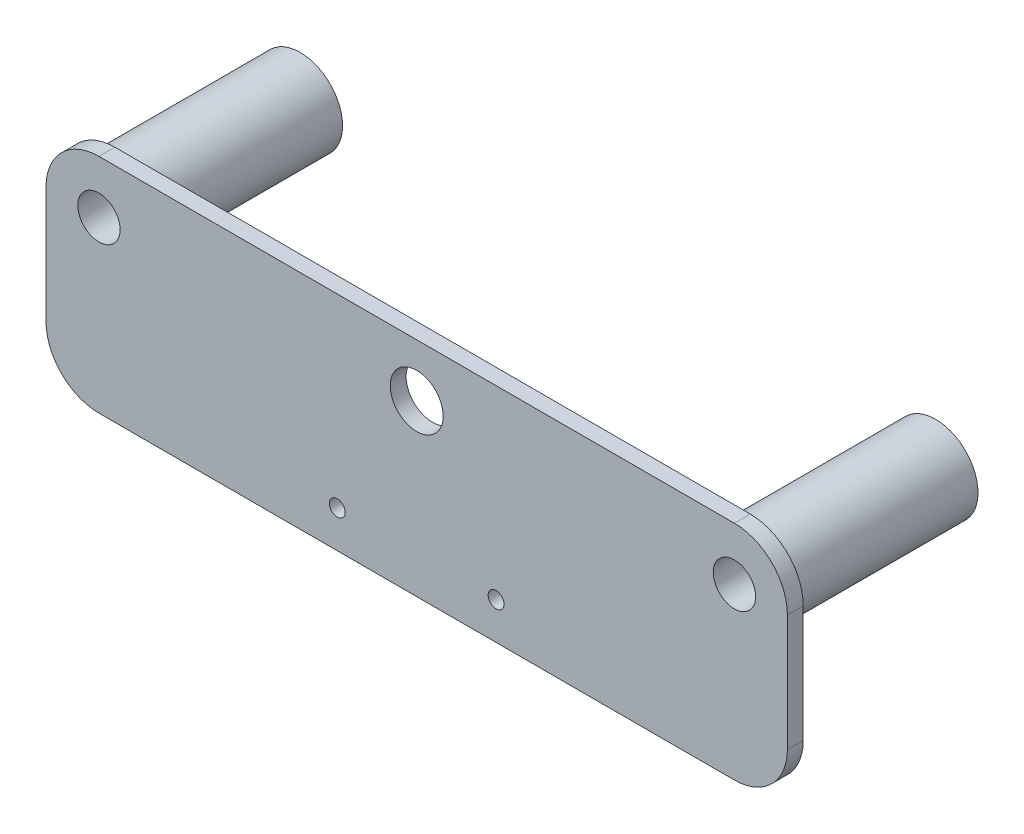
ISO-10303-21;
HEADER;
FILE_DESCRIPTION(('STEP AP214'),'2;1');
FILE_NAME('part.step','',(''),(''),'','','');
FILE_SCHEMA(('AUTOMOTIVE_DESIGN { 1 0 10303 214 1 1 1 1 }'));
ENDSEC;
DATA;
#1=APPLICATION_CONTEXT('core data for automotive mechanical design processes');
#2=APPLICATION_PROTOCOL_DEFINITION('international standard','automotive_design',2000,#1);
#3=PRODUCT_CONTEXT('',#1,'mechanical');
#4=PRODUCT('Part','Part','',(#3));
#5=PRODUCT_RELATED_PRODUCT_CATEGORY('part','',(#4));
#6=PRODUCT_DEFINITION_FORMATION('','',#4);
#7=PRODUCT_DEFINITION_CONTEXT('part definition',#1,'design');
#8=PRODUCT_DEFINITION('design','',#6,#7);
#9=PRODUCT_DEFINITION_SHAPE('','',#8);
#10=(LENGTH_UNIT() NAMED_UNIT(*) SI_UNIT(.MILLI.,.METRE.));
#11=(NAMED_UNIT(*) PLANE_ANGLE_UNIT() SI_UNIT($,.RADIAN.));
#12=(NAMED_UNIT(*) SI_UNIT($,.STERADIAN.) SOLID_ANGLE_UNIT());
#13=UNCERTAINTY_MEASURE_WITH_UNIT(LENGTH_MEASURE(1.E-05),#10,'distance_accuracy_value','');
#14=(GEOMETRIC_REPRESENTATION_CONTEXT(3) GLOBAL_UNCERTAINTY_ASSIGNED_CONTEXT((#13)) GLOBAL_UNIT_ASSIGNED_CONTEXT((#10,
#11,#12)) REPRESENTATION_CONTEXT('',''));
#15=CARTESIAN_POINT('',(0.,0.,0.));
#16=DIRECTION('',(0.,0.,1.));
#17=DIRECTION('',(1.,0.,0.));
#18=AXIS2_PLACEMENT_3D('',#15,#16,#17);
#19=CARTESIAN_POINT('',(0.,42.,3.));
#20=DIRECTION('',(0.,0.,1.));
#21=DIRECTION('',(1.,0.,0.));
#22=AXIS2_PLACEMENT_3D('',#19,#20,#21);
#23=PLANE('',#22);
#24=DIRECTION('',(0.,-1.,0.));
#25=VECTOR('',#24,1.);
#26=CARTESIAN_POINT('',(-140.,0.,3.));
#27=LINE('',#26,#25);
#28=CARTESIAN_POINT('',(-140.,32.,3.));
#29=VERTEX_POINT('',#28);
#30=CARTESIAN_POINT('',(-140.,10.,3.));
#31=VERTEX_POINT('',#30);
#32=EDGE_CURVE('E118',#29,#31,#27,.T.);
#33=ORIENTED_EDGE('',*,*,#32,.T.);
#34=CARTESIAN_POINT('',(-130.,10.,3.));
#35=DIRECTION('',(0.,0.,1.));
#36=DIRECTION('',(1.,0.,0.));
#37=AXIS2_PLACEMENT_3D('',#34,#35,#36);
#38=CIRCLE('',#37,10.);
#39=CARTESIAN_POINT('',(-130.,0.,3.));
#40=VERTEX_POINT('',#39);
#41=EDGE_CURVE('E42',#31,#40,#38,.T.);
#42=ORIENTED_EDGE('',*,*,#41,.T.);
#43=DIRECTION('',(1.,0.,0.));
#44=VECTOR('',#43,1.);
#45=CARTESIAN_POINT('',(0.,0.,3.));
#46=LINE('',#45,#44);
#47=CARTESIAN_POINT('',(-10.,0.,3.));
#48=VERTEX_POINT('',#47);
#49=EDGE_CURVE('E119',#40,#48,#46,.T.);
#50=ORIENTED_EDGE('',*,*,#49,.T.);
#51=CARTESIAN_POINT('',(-10.,10.,3.));
#52=DIRECTION('',(0.,0.,1.));
#53=DIRECTION('',(1.,0.,0.));
#54=AXIS2_PLACEMENT_3D('',#51,#52,#53);
#55=CIRCLE('',#54,10.);
#56=CARTESIAN_POINT('',(0.,10.,3.));
#57=VERTEX_POINT('',#56);
#58=EDGE_CURVE('E50',#48,#57,#55,.T.);
#59=ORIENTED_EDGE('',*,*,#58,.T.);
#60=DIRECTION('',(0.,1.,0.));
#61=VECTOR('',#60,1.);
#62=CARTESIAN_POINT('',(0.,0.,3.));
#63=LINE('',#62,#61);
#64=CARTESIAN_POINT('',(0.,32.,3.));
#65=VERTEX_POINT('',#64);
#66=EDGE_CURVE('E129',#57,#65,#63,.T.);
#67=ORIENTED_EDGE('',*,*,#66,.T.);
#68=CARTESIAN_POINT('',(-9.99999999999999,32.,3.));
#69=DIRECTION('',(0.,0.,1.));
#70=DIRECTION('',(1.,0.,0.));
#71=AXIS2_PLACEMENT_3D('',#68,#69,#70);
#72=CIRCLE('',#71,10.);
#73=CARTESIAN_POINT('',(-9.99999999999999,42.,3.));
#74=VERTEX_POINT('',#73);
#75=EDGE_CURVE('E140',#65,#74,#72,.T.);
#76=ORIENTED_EDGE('',*,*,#75,.T.);
#77=DIRECTION('',(-1.,0.,0.));
#78=VECTOR('',#77,1.);
#79=CARTESIAN_POINT('',(0.,42.,3.));
#80=LINE('',#79,#78);
#81=CARTESIAN_POINT('',(-130.,42.,3.));
#82=VERTEX_POINT('',#81);
#83=EDGE_CURVE('E196',#74,#82,#80,.T.);
#84=ORIENTED_EDGE('',*,*,#83,.T.);
#85=CARTESIAN_POINT('',(-130.,32.,3.));
#86=DIRECTION('',(0.,0.,1.));
#87=DIRECTION('',(1.,0.,0.));
#88=AXIS2_PLACEMENT_3D('',#85,#86,#87);
#89=CIRCLE('',#88,10.);
#90=EDGE_CURVE('E142',#82,#29,#89,.T.);
#91=ORIENTED_EDGE('',*,*,#90,.T.);
#92=EDGE_LOOP('',(#33,#42,#50,#59,#67,#76,#84,#91));
#93=FACE_BOUND('',#92,.T.);
#94=CARTESIAN_POINT('',(-70.,32.,3.));
#95=DIRECTION('',(0.,0.,1.));
#96=DIRECTION('',(1.,0.,0.));
#97=AXIS2_PLACEMENT_3D('',#94,#95,#96);
#98=CIRCLE('',#97,4.99999999999999);
#99=CARTESIAN_POINT('',(-65.,32.,3.));
#100=VERTEX_POINT('',#99);
#101=EDGE_CURVE('E190',#100,#100,#98,.T.);
#102=ORIENTED_EDGE('',*,*,#101,.F.);
#103=EDGE_LOOP('',(#102));
#104=FACE_BOUND('',#103,.T.);
#105=CARTESIAN_POINT('',(-55.,6.99999999999999,3.));
#106=DIRECTION('',(0.,0.,1.));
#107=DIRECTION('',(1.,0.,0.));
#108=AXIS2_PLACEMENT_3D('',#105,#106,#107);
#109=CIRCLE('',#108,1.5);
#110=CARTESIAN_POINT('',(-53.5,6.99999999999999,3.));
#111=VERTEX_POINT('',#110);
#112=EDGE_CURVE('E181',#111,#111,#109,.T.);
#113=ORIENTED_EDGE('',*,*,#112,.F.);
#114=EDGE_LOOP('',(#113));
#115=FACE_BOUND('',#114,.T.);
#116=CARTESIAN_POINT('',(-85.,7.,3.));
#117=DIRECTION('',(0.,0.,1.));
#118=DIRECTION('',(-1.,0.,0.));
#119=AXIS2_PLACEMENT_3D('',#116,#117,#118);
#120=CIRCLE('',#119,1.5);
#121=CARTESIAN_POINT('',(-86.5,7.,3.));
#122=VERTEX_POINT('',#121);
#123=EDGE_CURVE('E164',#122,#122,#120,.T.);
#124=ORIENTED_EDGE('',*,*,#123,.F.);
#125=EDGE_LOOP('',(#124));
#126=FACE_BOUND('',#125,.T.);
#127=CARTESIAN_POINT('',(-9.99999999999998,32.,3.));
#128=DIRECTION('',(0.,0.,1.));
#129=DIRECTION('',(-1.,0.,0.));
#130=AXIS2_PLACEMENT_3D('',#127,#128,#129);
#131=CIRCLE('',#130,4.00000000000001);
#132=CARTESIAN_POINT('',(-14.,32.,3.));
#133=VERTEX_POINT('',#132);
#134=EDGE_CURVE('E176',#133,#133,#131,.T.);
#135=ORIENTED_EDGE('',*,*,#134,.F.);
#136=EDGE_LOOP('',(#135));
#137=FACE_BOUND('',#136,.T.);
#138=CARTESIAN_POINT('',(-130.,32.,3.));
#139=DIRECTION('',(0.,0.,1.));
#140=DIRECTION('',(1.,0.,0.));
#141=AXIS2_PLACEMENT_3D('',#138,#139,#140);
#142=CIRCLE('',#141,4.00000000000002);
#143=CARTESIAN_POINT('',(-126.,32.,3.));
#144=VERTEX_POINT('',#143);
#145=EDGE_CURVE('E184',#144,#144,#142,.T.);
#146=ORIENTED_EDGE('',*,*,#145,.F.);
#147=EDGE_LOOP('',(#146));
#148=FACE_BOUND('',#147,.T.);
#149=ADVANCED_FACE('F33',(#93,#104,#115,#126,#137,#148),#23,.T.);
#150=CARTESIAN_POINT('',(0.,42.,0.));
#151=DIRECTION('',(0.,0.,1.));
#152=DIRECTION('',(1.,0.,0.));
#153=AXIS2_PLACEMENT_3D('',#150,#151,#152);
#154=PLANE('',#153);
#155=CARTESIAN_POINT('',(-130.,32.,0.));
#156=DIRECTION('',(0.,0.,1.));
#157=DIRECTION('',(1.,0.,0.));
#158=AXIS2_PLACEMENT_3D('',#155,#156,#157);
#159=CIRCLE('',#158,8.00000000000001);
#160=CARTESIAN_POINT('',(-122.,32.,0.));
#161=VERTEX_POINT('',#160);
#162=EDGE_CURVE('E37',#161,#161,#159,.T.);
#163=ORIENTED_EDGE('',*,*,#162,.T.);
#164=EDGE_LOOP('',(#163));
#165=FACE_BOUND('',#164,.T.);
#166=CARTESIAN_POINT('',(-9.99999999999999,32.,0.));
#167=DIRECTION('',(0.,0.,1.));
#168=DIRECTION('',(1.,0.,0.));
#169=AXIS2_PLACEMENT_3D('',#166,#167,#168);
#170=CIRCLE('',#169,8.00000000000001);
#171=CARTESIAN_POINT('',(-1.99999999999999,32.,0.));
#172=VERTEX_POINT('',#171);
#173=EDGE_CURVE('E157',#172,#172,#170,.T.);
#174=ORIENTED_EDGE('',*,*,#173,.T.);
#175=EDGE_LOOP('',(#174));
#176=FACE_BOUND('',#175,.T.);
#177=DIRECTION('',(1.,0.,0.));
#178=VECTOR('',#177,1.);
#179=CARTESIAN_POINT('',(0.,0.,0.));
#180=LINE('',#179,#178);
#181=CARTESIAN_POINT('',(-130.,0.,0.));
#182=VERTEX_POINT('',#181);
#183=CARTESIAN_POINT('',(-10.,0.,0.));
#184=VERTEX_POINT('',#183);
#185=EDGE_CURVE('E125',#182,#184,#180,.T.);
#186=ORIENTED_EDGE('',*,*,#185,.F.);
#187=CARTESIAN_POINT('',(-130.,10.,0.));
#188=DIRECTION('',(0.,0.,1.));
#189=DIRECTION('',(1.,0.,0.));
#190=AXIS2_PLACEMENT_3D('',#187,#188,#189);
#191=CIRCLE('',#190,10.);
#192=CARTESIAN_POINT('',(-140.,10.,0.));
#193=VERTEX_POINT('',#192);
#194=EDGE_CURVE('E124',#182,#193,#191,.F.);
#195=ORIENTED_EDGE('',*,*,#194,.T.);
#196=DIRECTION('',(0.,-1.,0.));
#197=VECTOR('',#196,1.);
#198=CARTESIAN_POINT('',(-140.,0.,0.));
#199=LINE('',#198,#197);
#200=CARTESIAN_POINT('',(-140.,32.,0.));
#201=VERTEX_POINT('',#200);
#202=EDGE_CURVE('E117',#201,#193,#199,.T.);
#203=ORIENTED_EDGE('',*,*,#202,.F.);
#204=CARTESIAN_POINT('',(-130.,32.,0.));
#205=DIRECTION('',(0.,0.,1.));
#206=DIRECTION('',(1.,0.,0.));
#207=AXIS2_PLACEMENT_3D('',#204,#205,#206);
#208=CIRCLE('',#207,10.);
#209=CARTESIAN_POINT('',(-130.,42.,0.));
#210=VERTEX_POINT('',#209);
#211=EDGE_CURVE('E103',#201,#210,#208,.F.);
#212=ORIENTED_EDGE('',*,*,#211,.T.);
#213=DIRECTION('',(-1.,0.,0.));
#214=VECTOR('',#213,1.);
#215=CARTESIAN_POINT('',(0.,42.,0.));
#216=LINE('',#215,#214);
#217=CARTESIAN_POINT('',(-9.99999999999999,42.,0.));
#218=VERTEX_POINT('',#217);
#219=EDGE_CURVE('E126',#218,#210,#216,.T.);
#220=ORIENTED_EDGE('',*,*,#219,.F.);
#221=CARTESIAN_POINT('',(-9.99999999999999,32.,0.));
#222=DIRECTION('',(0.,0.,1.));
#223=DIRECTION('',(1.,0.,0.));
#224=AXIS2_PLACEMENT_3D('',#221,#222,#223);
#225=CIRCLE('',#224,10.);
#226=CARTESIAN_POINT('',(0.,32.,0.));
#227=VERTEX_POINT('',#226);
#228=EDGE_CURVE('E114',#218,#227,#225,.F.);
#229=ORIENTED_EDGE('',*,*,#228,.T.);
#230=DIRECTION('',(0.,1.,0.));
#231=VECTOR('',#230,1.);
#232=CARTESIAN_POINT('',(0.,0.,0.));
#233=LINE('',#232,#231);
#234=CARTESIAN_POINT('',(0.,10.,0.));
#235=VERTEX_POINT('',#234);
#236=EDGE_CURVE('E131',#235,#227,#233,.T.);
#237=ORIENTED_EDGE('',*,*,#236,.F.);
#238=CARTESIAN_POINT('',(-10.,10.,0.));
#239=DIRECTION('',(0.,0.,1.));
#240=DIRECTION('',(1.,0.,0.));
#241=AXIS2_PLACEMENT_3D('',#238,#239,#240);
#242=CIRCLE('',#241,10.);
#243=EDGE_CURVE('E152',#235,#184,#242,.F.);
#244=ORIENTED_EDGE('',*,*,#243,.T.);
#245=EDGE_LOOP('',(#186,#195,#203,#212,#220,#229,#237,#244));
#246=FACE_BOUND('',#245,.T.);
#247=CARTESIAN_POINT('',(-70.,32.,0.));
#248=DIRECTION('',(0.,0.,1.));
#249=DIRECTION('',(1.,0.,0.));
#250=AXIS2_PLACEMENT_3D('',#247,#248,#249);
#251=CIRCLE('',#250,4.99999999999999);
#252=CARTESIAN_POINT('',(-65.,32.,0.));
#253=VERTEX_POINT('',#252);
#254=EDGE_CURVE('E189',#253,#253,#251,.T.);
#255=ORIENTED_EDGE('',*,*,#254,.T.);
#256=EDGE_LOOP('',(#255));
#257=FACE_BOUND('',#256,.T.);
#258=CARTESIAN_POINT('',(-55.,6.99999999999999,0.));
#259=DIRECTION('',(0.,0.,1.));
#260=DIRECTION('',(1.,0.,0.));
#261=AXIS2_PLACEMENT_3D('',#258,#259,#260);
#262=CIRCLE('',#261,1.5);
#263=CARTESIAN_POINT('',(-53.5,6.99999999999999,0.));
#264=VERTEX_POINT('',#263);
#265=EDGE_CURVE('E180',#264,#264,#262,.T.);
#266=ORIENTED_EDGE('',*,*,#265,.T.);
#267=EDGE_LOOP('',(#266));
#268=FACE_BOUND('',#267,.T.);
#269=CARTESIAN_POINT('',(-85.,7.,0.));
#270=DIRECTION('',(0.,0.,1.));
#271=DIRECTION('',(-1.,0.,0.));
#272=AXIS2_PLACEMENT_3D('',#269,#270,#271);
#273=CIRCLE('',#272,1.5);
#274=CARTESIAN_POINT('',(-86.5,7.,0.));
#275=VERTEX_POINT('',#274);
#276=EDGE_CURVE('E159',#275,#275,#273,.T.);
#277=ORIENTED_EDGE('',*,*,#276,.T.);
#278=EDGE_LOOP('',(#277));
#279=FACE_BOUND('',#278,.T.);
#280=ADVANCED_FACE('F122',(#165,#176,#246,#257,#268,#279),#154,.F.);
#281=CARTESIAN_POINT('',(0.,0.,3.));
#282=DIRECTION('',(-1.,0.,0.));
#283=DIRECTION('',(0.,-1.,0.));
#284=AXIS2_PLACEMENT_3D('',#281,#282,#283);
#285=PLANE('',#284);
#286=ORIENTED_EDGE('',*,*,#66,.F.);
#287=DIRECTION('',(0.,0.,-1.));
#288=VECTOR('',#287,1.);
#289=CARTESIAN_POINT('',(0.,10.,3.));
#290=LINE('',#289,#288);
#291=EDGE_CURVE('E11',#57,#235,#290,.T.);
#292=ORIENTED_EDGE('',*,*,#291,.T.);
#293=ORIENTED_EDGE('',*,*,#236,.T.);
#294=DIRECTION('',(0.,0.,-1.));
#295=VECTOR('',#294,1.);
#296=CARTESIAN_POINT('',(0.,32.,3.));
#297=LINE('',#296,#295);
#298=EDGE_CURVE('E144',#227,#65,#297,.F.);
#299=ORIENTED_EDGE('',*,*,#298,.T.);
#300=EDGE_LOOP('',(#286,#292,#293,#299));
#301=FACE_BOUND('',#300,.T.);
#302=ADVANCED_FACE('F202',(#301),#285,.F.);
#303=CARTESIAN_POINT('',(0.,42.,3.));
#304=DIRECTION('',(0.,-1.,0.));
#305=DIRECTION('',(0.,0.,-1.));
#306=AXIS2_PLACEMENT_3D('',#303,#304,#305);
#307=PLANE('',#306);
#308=ORIENTED_EDGE('',*,*,#219,.T.);
#309=DIRECTION('',(0.,0.,-1.));
#310=VECTOR('',#309,1.);
#311=CARTESIAN_POINT('',(-130.,42.,3.));
#312=LINE('',#311,#310);
#313=EDGE_CURVE('E108',#210,#82,#312,.F.);
#314=ORIENTED_EDGE('',*,*,#313,.T.);
#315=ORIENTED_EDGE('',*,*,#83,.F.);
#316=DIRECTION('',(0.,0.,-1.));
#317=VECTOR('',#316,1.);
#318=CARTESIAN_POINT('',(-9.99999999999999,42.,3.));
#319=LINE('',#318,#317);
#320=EDGE_CURVE('E113',#74,#218,#319,.T.);
#321=ORIENTED_EDGE('',*,*,#320,.T.);
#322=EDGE_LOOP('',(#308,#314,#315,#321));
#323=FACE_BOUND('',#322,.T.);
#324=ADVANCED_FACE('F212',(#323),#307,.F.);
#325=CARTESIAN_POINT('',(-140.,0.,3.));
#326=DIRECTION('',(1.,0.,0.));
#327=DIRECTION('',(0.,0.,-1.));
#328=AXIS2_PLACEMENT_3D('',#325,#326,#327);
#329=PLANE('',#328);
#330=ORIENTED_EDGE('',*,*,#202,.T.);
#331=DIRECTION('',(0.,0.,-1.));
#332=VECTOR('',#331,1.);
#333=CARTESIAN_POINT('',(-140.,10.,3.));
#334=LINE('',#333,#332);
#335=EDGE_CURVE('E58',#193,#31,#334,.F.);
#336=ORIENTED_EDGE('',*,*,#335,.T.);
#337=ORIENTED_EDGE('',*,*,#32,.F.);
#338=DIRECTION('',(0.,0.,-1.));
#339=VECTOR('',#338,1.);
#340=CARTESIAN_POINT('',(-140.,32.,3.));
#341=LINE('',#340,#339);
#342=EDGE_CURVE('E107',#29,#201,#341,.T.);
#343=ORIENTED_EDGE('',*,*,#342,.T.);
#344=EDGE_LOOP('',(#330,#336,#337,#343));
#345=FACE_BOUND('',#344,.T.);
#346=ADVANCED_FACE('F116',(#345),#329,.F.);
#347=CARTESIAN_POINT('',(0.,0.,3.));
#348=DIRECTION('',(0.,1.,0.));
#349=DIRECTION('',(-1.,0.,0.));
#350=AXIS2_PLACEMENT_3D('',#347,#348,#349);
#351=PLANE('',#350);
#352=ORIENTED_EDGE('',*,*,#49,.F.);
#353=DIRECTION('',(0.,0.,-1.));
#354=VECTOR('',#353,1.);
#355=CARTESIAN_POINT('',(-130.,0.,3.));
#356=LINE('',#355,#354);
#357=EDGE_CURVE('E149',#40,#182,#356,.T.);
#358=ORIENTED_EDGE('',*,*,#357,.T.);
#359=ORIENTED_EDGE('',*,*,#185,.T.);
#360=DIRECTION('',(0.,0.,-1.));
#361=VECTOR('',#360,1.);
#362=CARTESIAN_POINT('',(-10.,0.,3.));
#363=LINE('',#362,#361);
#364=EDGE_CURVE('E147',#184,#48,#363,.F.);
#365=ORIENTED_EDGE('',*,*,#364,.T.);
#366=EDGE_LOOP('',(#352,#358,#359,#365));
#367=FACE_BOUND('',#366,.T.);
#368=ADVANCED_FACE('F219',(#367),#351,.F.);
#369=CARTESIAN_POINT('',(-70.,32.,3.));
#370=DIRECTION('',(0.,0.,-1.));
#371=DIRECTION('',(-1.,0.,0.));
#372=AXIS2_PLACEMENT_3D('',#369,#370,#371);
#373=CYLINDRICAL_SURFACE('',#372,4.99999999999999);
#374=ORIENTED_EDGE('',*,*,#101,.T.);
#375=EDGE_LOOP('',(#374));
#376=FACE_BOUND('',#375,.T.);
#377=ORIENTED_EDGE('',*,*,#254,.F.);
#378=EDGE_LOOP('',(#377));
#379=FACE_BOUND('',#378,.T.);
#380=ADVANCED_FACE('F230',(#376,#379),#373,.F.);
#381=CARTESIAN_POINT('',(-130.,32.,3.));
#382=DIRECTION('',(0.,0.,-1.));
#383=DIRECTION('',(-1.,0.,0.));
#384=AXIS2_PLACEMENT_3D('',#381,#382,#383);
#385=CYLINDRICAL_SURFACE('',#384,4.00000000000002);
#386=ORIENTED_EDGE('',*,*,#145,.T.);
#387=EDGE_LOOP('',(#386));
#388=FACE_BOUND('',#387,.T.);
#389=CARTESIAN_POINT('',(-130.,32.,-35.));
#390=DIRECTION('',(0.,0.,1.));
#391=DIRECTION('',(1.,0.,0.));
#392=AXIS2_PLACEMENT_3D('',#389,#390,#391);
#393=CIRCLE('',#392,3.99999999999999);
#394=CARTESIAN_POINT('',(-126.,32.,-35.));
#395=VERTEX_POINT('',#394);
#396=EDGE_CURVE('E283',#395,#395,#393,.T.);
#397=ORIENTED_EDGE('',*,*,#396,.F.);
#398=EDGE_LOOP('',(#397));
#399=FACE_BOUND('',#398,.T.);
#400=ADVANCED_FACE('F238',(#388,#399),#385,.F.);
#401=CARTESIAN_POINT('',(-55.,6.99999999999999,3.));
#402=DIRECTION('',(0.,0.,-1.));
#403=DIRECTION('',(-1.,0.,0.));
#404=AXIS2_PLACEMENT_3D('',#401,#402,#403);
#405=CYLINDRICAL_SURFACE('',#404,1.5);
#406=ORIENTED_EDGE('',*,*,#112,.T.);
#407=EDGE_LOOP('',(#406));
#408=FACE_BOUND('',#407,.T.);
#409=ORIENTED_EDGE('',*,*,#265,.F.);
#410=EDGE_LOOP('',(#409));
#411=FACE_BOUND('',#410,.T.);
#412=ADVANCED_FACE('F266',(#408,#411),#405,.F.);
#413=CARTESIAN_POINT('',(-9.99999999999998,32.,3.));
#414=DIRECTION('',(0.,0.,-1.));
#415=DIRECTION('',(-1.,0.,0.));
#416=AXIS2_PLACEMENT_3D('',#413,#414,#415);
#417=CYLINDRICAL_SURFACE('',#416,4.00000000000001);
#418=ORIENTED_EDGE('',*,*,#134,.T.);
#419=EDGE_LOOP('',(#418));
#420=FACE_BOUND('',#419,.T.);
#421=CARTESIAN_POINT('',(-9.99999999999999,32.,-35.));
#422=DIRECTION('',(0.,0.,1.));
#423=DIRECTION('',(1.,0.,0.));
#424=AXIS2_PLACEMENT_3D('',#421,#422,#423);
#425=CIRCLE('',#424,4.00000000000001);
#426=CARTESIAN_POINT('',(-5.99999999999998,32.,-35.));
#427=VERTEX_POINT('',#426);
#428=EDGE_CURVE('E167',#427,#427,#425,.T.);
#429=ORIENTED_EDGE('',*,*,#428,.F.);
#430=EDGE_LOOP('',(#429));
#431=FACE_BOUND('',#430,.T.);
#432=ADVANCED_FACE('F260',(#420,#431),#417,.F.);
#433=CARTESIAN_POINT('',(-85.,7.,3.));
#434=DIRECTION('',(0.,0.,-1.));
#435=DIRECTION('',(-1.,0.,0.));
#436=AXIS2_PLACEMENT_3D('',#433,#434,#435);
#437=CYLINDRICAL_SURFACE('',#436,1.5);
#438=ORIENTED_EDGE('',*,*,#123,.T.);
#439=EDGE_LOOP('',(#438));
#440=FACE_BOUND('',#439,.T.);
#441=ORIENTED_EDGE('',*,*,#276,.F.);
#442=EDGE_LOOP('',(#441));
#443=FACE_BOUND('',#442,.T.);
#444=ADVANCED_FACE('F256',(#440,#443),#437,.F.);
#445=CARTESIAN_POINT('',(-130.,32.,3.));
#446=DIRECTION('',(0.,0.,-1.));
#447=DIRECTION('',(-1.,0.,0.));
#448=AXIS2_PLACEMENT_3D('',#445,#446,#447);
#449=CYLINDRICAL_SURFACE('',#448,10.);
#450=ORIENTED_EDGE('',*,*,#90,.F.);
#451=ORIENTED_EDGE('',*,*,#313,.F.);
#452=ORIENTED_EDGE('',*,*,#211,.F.);
#453=ORIENTED_EDGE('',*,*,#342,.F.);
#454=EDGE_LOOP('',(#450,#451,#452,#453));
#455=FACE_BOUND('',#454,.T.);
#456=ADVANCED_FACE('F106',(#455),#449,.T.);
#457=CARTESIAN_POINT('',(-9.99999999999999,32.,3.));
#458=DIRECTION('',(0.,0.,-1.));
#459=DIRECTION('',(-1.,0.,0.));
#460=AXIS2_PLACEMENT_3D('',#457,#458,#459);
#461=CYLINDRICAL_SURFACE('',#460,10.);
#462=ORIENTED_EDGE('',*,*,#75,.F.);
#463=ORIENTED_EDGE('',*,*,#298,.F.);
#464=ORIENTED_EDGE('',*,*,#228,.F.);
#465=ORIENTED_EDGE('',*,*,#320,.F.);
#466=EDGE_LOOP('',(#462,#463,#464,#465));
#467=FACE_BOUND('',#466,.T.);
#468=ADVANCED_FACE('F208',(#467),#461,.T.);
#469=CARTESIAN_POINT('',(-130.,10.,3.));
#470=DIRECTION('',(0.,0.,-1.));
#471=DIRECTION('',(-1.,0.,0.));
#472=AXIS2_PLACEMENT_3D('',#469,#470,#471);
#473=CYLINDRICAL_SURFACE('',#472,10.);
#474=ORIENTED_EDGE('',*,*,#41,.F.);
#475=ORIENTED_EDGE('',*,*,#335,.F.);
#476=ORIENTED_EDGE('',*,*,#194,.F.);
#477=ORIENTED_EDGE('',*,*,#357,.F.);
#478=EDGE_LOOP('',(#474,#475,#476,#477));
#479=FACE_BOUND('',#478,.T.);
#480=ADVANCED_FACE('F245',(#479),#473,.T.);
#481=CARTESIAN_POINT('',(-10.,10.,3.));
#482=DIRECTION('',(0.,0.,-1.));
#483=DIRECTION('',(-1.,0.,0.));
#484=AXIS2_PLACEMENT_3D('',#481,#482,#483);
#485=CYLINDRICAL_SURFACE('',#484,10.);
#486=ORIENTED_EDGE('',*,*,#58,.F.);
#487=ORIENTED_EDGE('',*,*,#364,.F.);
#488=ORIENTED_EDGE('',*,*,#243,.F.);
#489=ORIENTED_EDGE('',*,*,#291,.F.);
#490=EDGE_LOOP('',(#486,#487,#488,#489));
#491=FACE_BOUND('',#490,.T.);
#492=ADVANCED_FACE('F35',(#491),#485,.T.);
#493=CARTESIAN_POINT('',(-9.99999999999999,32.,-35.));
#494=DIRECTION('',(0.,0.,1.));
#495=DIRECTION('',(1.,0.,0.));
#496=AXIS2_PLACEMENT_3D('',#493,#494,#495);
#497=CYLINDRICAL_SURFACE('',#496,8.00000000000001);
#498=CARTESIAN_POINT('',(-9.99999999999999,32.,-35.));
#499=DIRECTION('',(0.,0.,1.));
#500=DIRECTION('',(1.,0.,0.));
#501=AXIS2_PLACEMENT_3D('',#498,#499,#500);
#502=CIRCLE('',#501,8.00000000000001);
#503=CARTESIAN_POINT('',(-1.99999999999999,32.,-35.));
#504=VERTEX_POINT('',#503);
#505=EDGE_CURVE('E160',#504,#504,#502,.T.);
#506=ORIENTED_EDGE('',*,*,#505,.T.);
#507=EDGE_LOOP('',(#506));
#508=FACE_BOUND('',#507,.T.);
#509=ORIENTED_EDGE('',*,*,#173,.F.);
#510=EDGE_LOOP('',(#509));
#511=FACE_BOUND('',#510,.T.);
#512=ADVANCED_FACE('F251',(#508,#511),#497,.T.);
#513=CARTESIAN_POINT('',(-9.99999999999999,32.,-35.));
#514=DIRECTION('',(0.,0.,1.));
#515=DIRECTION('',(1.,0.,0.));
#516=AXIS2_PLACEMENT_3D('',#513,#514,#515);
#517=PLANE('',#516);
#518=ORIENTED_EDGE('',*,*,#428,.T.);
#519=EDGE_LOOP('',(#518));
#520=FACE_BOUND('',#519,.T.);
#521=ORIENTED_EDGE('',*,*,#505,.F.);
#522=EDGE_LOOP('',(#521));
#523=FACE_BOUND('',#522,.T.);
#524=ADVANCED_FACE('F296',(#520,#523),#517,.F.);
#525=CARTESIAN_POINT('',(-130.,32.,-35.));
#526=DIRECTION('',(0.,0.,1.));
#527=DIRECTION('',(1.,0.,0.));
#528=AXIS2_PLACEMENT_3D('',#525,#526,#527);
#529=CYLINDRICAL_SURFACE('',#528,8.00000000000001);
#530=CARTESIAN_POINT('',(-130.,32.,-35.));
#531=DIRECTION('',(0.,0.,1.));
#532=DIRECTION('',(1.,0.,0.));
#533=AXIS2_PLACEMENT_3D('',#530,#531,#532);
#534=CIRCLE('',#533,8.00000000000001);
#535=CARTESIAN_POINT('',(-122.,32.,-35.));
#536=VERTEX_POINT('',#535);
#537=EDGE_CURVE('E285',#536,#536,#534,.T.);
#538=ORIENTED_EDGE('',*,*,#537,.T.);
#539=EDGE_LOOP('',(#538));
#540=FACE_BOUND('',#539,.T.);
#541=ORIENTED_EDGE('',*,*,#162,.F.);
#542=EDGE_LOOP('',(#541));
#543=FACE_BOUND('',#542,.T.);
#544=ADVANCED_FACE('F293',(#540,#543),#529,.T.);
#545=CARTESIAN_POINT('',(-130.,32.,-35.));
#546=DIRECTION('',(0.,0.,1.));
#547=DIRECTION('',(1.,0.,0.));
#548=AXIS2_PLACEMENT_3D('',#545,#546,#547);
#549=PLANE('',#548);
#550=ORIENTED_EDGE('',*,*,#396,.T.);
#551=EDGE_LOOP('',(#550));
#552=FACE_BOUND('',#551,.T.);
#553=ORIENTED_EDGE('',*,*,#537,.F.);
#554=EDGE_LOOP('',(#553));
#555=FACE_BOUND('',#554,.T.);
#556=ADVANCED_FACE('F295',(#552,#555),#549,.F.);
#557=CLOSED_SHELL('',(#149,#280,#302,#324,#346,#368,#380,#400,#412,#432,#444,#456,#468,#480,
#492,#512,#524,#544,#556));
#558=MANIFOLD_SOLID_BREP('B2',#557);
#559=ADVANCED_BREP_SHAPE_REPRESENTATION('',(#18,#558),#14);
#560=SHAPE_DEFINITION_REPRESENTATION(#9,#559);
ENDSEC;
END-ISO-10303-21;
